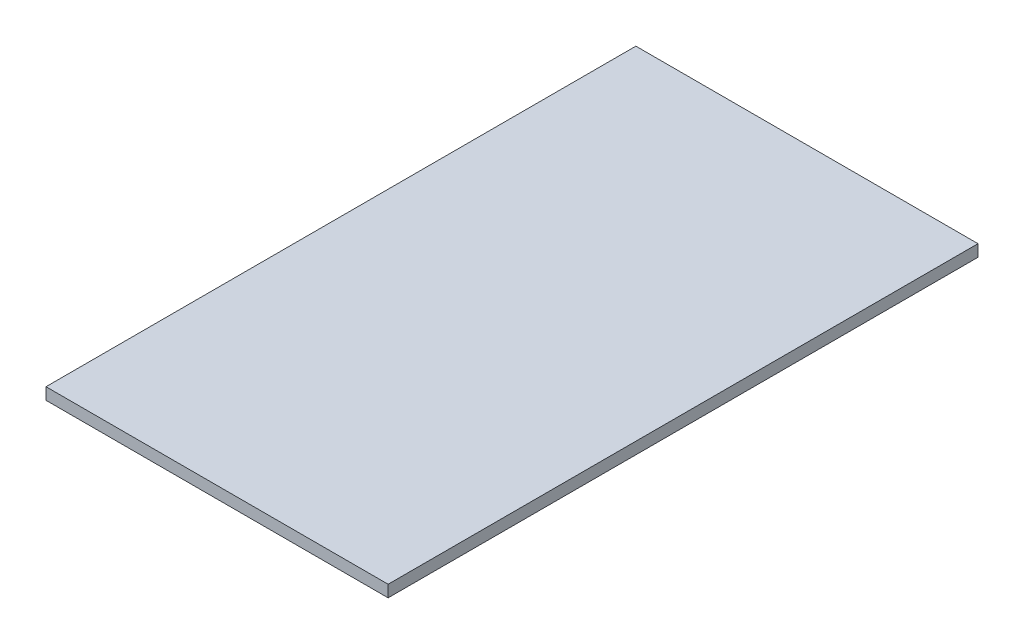
ISO-10303-21;
HEADER;
FILE_DESCRIPTION(('STEP AP214'),'2;1');
FILE_NAME('part.step','',(''),(''),'','','');
FILE_SCHEMA(('AUTOMOTIVE_DESIGN { 1 0 10303 214 1 1 1 1 }'));
ENDSEC;
DATA;
#1=APPLICATION_CONTEXT('core data for automotive mechanical design processes');
#2=APPLICATION_PROTOCOL_DEFINITION('international standard','automotive_design',2000,#1);
#3=PRODUCT_CONTEXT('',#1,'mechanical');
#4=PRODUCT('Part','Part','',(#3));
#5=PRODUCT_RELATED_PRODUCT_CATEGORY('part','',(#4));
#6=PRODUCT_DEFINITION_FORMATION('','',#4);
#7=PRODUCT_DEFINITION_CONTEXT('part definition',#1,'design');
#8=PRODUCT_DEFINITION('design','',#6,#7);
#9=PRODUCT_DEFINITION_SHAPE('','',#8);
#10=(LENGTH_UNIT() NAMED_UNIT(*) SI_UNIT(.MILLI.,.METRE.));
#11=(NAMED_UNIT(*) PLANE_ANGLE_UNIT() SI_UNIT($,.RADIAN.));
#12=(NAMED_UNIT(*) SI_UNIT($,.STERADIAN.) SOLID_ANGLE_UNIT());
#13=UNCERTAINTY_MEASURE_WITH_UNIT(LENGTH_MEASURE(1.E-05),#10,'distance_accuracy_value','');
#14=(GEOMETRIC_REPRESENTATION_CONTEXT(3) GLOBAL_UNCERTAINTY_ASSIGNED_CONTEXT((#13)) GLOBAL_UNIT_ASSIGNED_CONTEXT((#10,
#11,#12)) REPRESENTATION_CONTEXT('',''));
#15=CARTESIAN_POINT('',(0.,0.,0.));
#16=DIRECTION('',(0.,0.,1.));
#17=DIRECTION('',(1.,0.,0.));
#18=AXIS2_PLACEMENT_3D('',#15,#16,#17);
#19=CARTESIAN_POINT('',(0.,6.35,0.));
#20=DIRECTION('',(1.,0.,0.));
#21=DIRECTION('',(0.,0.,-1.));
#22=AXIS2_PLACEMENT_3D('',#19,#20,#21);
#23=PLANE('',#22);
#24=DIRECTION('',(0.,0.,1.));
#25=VECTOR('',#24,1.);
#26=CARTESIAN_POINT('',(0.,0.,0.));
#27=LINE('',#26,#25);
#28=CARTESIAN_POINT('',(0.,0.,-317.5));
#29=VERTEX_POINT('',#28);
#30=CARTESIAN_POINT('',(0.,0.,0.));
#31=VERTEX_POINT('',#30);
#32=EDGE_CURVE('E95',#29,#31,#27,.T.);
#33=ORIENTED_EDGE('',*,*,#32,.T.);
#34=DIRECTION('',(0.,-1.,0.));
#35=VECTOR('',#34,1.);
#36=CARTESIAN_POINT('',(0.,6.35,0.));
#37=LINE('',#36,#35);
#38=CARTESIAN_POINT('',(0.,6.35,0.));
#39=VERTEX_POINT('',#38);
#40=EDGE_CURVE('E11',#39,#31,#37,.T.);
#41=ORIENTED_EDGE('',*,*,#40,.F.);
#42=DIRECTION('',(0.,0.,1.));
#43=VECTOR('',#42,1.);
#44=CARTESIAN_POINT('',(0.,6.35,0.));
#45=LINE('',#44,#43);
#46=CARTESIAN_POINT('',(0.,6.35,-317.5));
#47=VERTEX_POINT('',#46);
#48=EDGE_CURVE('E83',#47,#39,#45,.T.);
#49=ORIENTED_EDGE('',*,*,#48,.F.);
#50=DIRECTION('',(0.,-1.,0.));
#51=VECTOR('',#50,1.);
#52=CARTESIAN_POINT('',(0.,6.35,-317.5));
#53=LINE('',#52,#51);
#54=EDGE_CURVE('E91',#47,#29,#53,.T.);
#55=ORIENTED_EDGE('',*,*,#54,.T.);
#56=EDGE_LOOP('',(#33,#41,#49,#55));
#57=FACE_BOUND('',#56,.T.);
#58=ADVANCED_FACE('F32',(#57),#23,.F.);
#59=CARTESIAN_POINT('',(0.,6.35,0.));
#60=DIRECTION('',(0.,0.,-1.));
#61=DIRECTION('',(-1.,0.,0.));
#62=AXIS2_PLACEMENT_3D('',#59,#60,#61);
#63=PLANE('',#62);
#64=DIRECTION('',(1.,0.,0.));
#65=VECTOR('',#64,1.);
#66=CARTESIAN_POINT('',(0.,0.,0.));
#67=LINE('',#66,#65);
#68=CARTESIAN_POINT('',(184.15,0.,0.));
#69=VERTEX_POINT('',#68);
#70=EDGE_CURVE('E87',#31,#69,#67,.T.);
#71=ORIENTED_EDGE('',*,*,#70,.T.);
#72=DIRECTION('',(0.,-1.,0.));
#73=VECTOR('',#72,1.);
#74=CARTESIAN_POINT('',(184.15,6.35,0.));
#75=LINE('',#74,#73);
#76=CARTESIAN_POINT('',(184.15,6.35,0.));
#77=VERTEX_POINT('',#76);
#78=EDGE_CURVE('E40',#77,#69,#75,.T.);
#79=ORIENTED_EDGE('',*,*,#78,.F.);
#80=DIRECTION('',(1.,0.,0.));
#81=VECTOR('',#80,1.);
#82=CARTESIAN_POINT('',(0.,6.35,0.));
#83=LINE('',#82,#81);
#84=EDGE_CURVE('E78',#39,#77,#83,.T.);
#85=ORIENTED_EDGE('',*,*,#84,.F.);
#86=ORIENTED_EDGE('',*,*,#40,.T.);
#87=EDGE_LOOP('',(#71,#79,#85,#86));
#88=FACE_BOUND('',#87,.T.);
#89=ADVANCED_FACE('F86',(#88),#63,.F.);
#90=CARTESIAN_POINT('',(184.15,6.35,0.));
#91=DIRECTION('',(-1.,0.,0.));
#92=DIRECTION('',(0.,0.,1.));
#93=AXIS2_PLACEMENT_3D('',#90,#91,#92);
#94=PLANE('',#93);
#95=DIRECTION('',(0.,0.,-1.));
#96=VECTOR('',#95,1.);
#97=CARTESIAN_POINT('',(184.15,0.,0.));
#98=LINE('',#97,#96);
#99=CARTESIAN_POINT('',(184.15,0.,-317.5));
#100=VERTEX_POINT('',#99);
#101=EDGE_CURVE('E65',#69,#100,#98,.T.);
#102=ORIENTED_EDGE('',*,*,#101,.T.);
#103=DIRECTION('',(0.,-1.,0.));
#104=VECTOR('',#103,1.);
#105=CARTESIAN_POINT('',(184.15,6.35,-317.5));
#106=LINE('',#105,#104);
#107=CARTESIAN_POINT('',(184.15,6.35,-317.5));
#108=VERTEX_POINT('',#107);
#109=EDGE_CURVE('E88',#108,#100,#106,.T.);
#110=ORIENTED_EDGE('',*,*,#109,.F.);
#111=DIRECTION('',(0.,0.,-1.));
#112=VECTOR('',#111,1.);
#113=CARTESIAN_POINT('',(184.15,6.35,0.));
#114=LINE('',#113,#112);
#115=EDGE_CURVE('E81',#77,#108,#114,.T.);
#116=ORIENTED_EDGE('',*,*,#115,.F.);
#117=ORIENTED_EDGE('',*,*,#78,.T.);
#118=EDGE_LOOP('',(#102,#110,#116,#117));
#119=FACE_BOUND('',#118,.T.);
#120=ADVANCED_FACE('F89',(#119),#94,.F.);
#121=CARTESIAN_POINT('',(0.,6.35,-317.5));
#122=DIRECTION('',(0.,0.,1.));
#123=DIRECTION('',(1.,0.,0.));
#124=AXIS2_PLACEMENT_3D('',#121,#122,#123);
#125=PLANE('',#124);
#126=DIRECTION('',(-1.,0.,0.));
#127=VECTOR('',#126,1.);
#128=CARTESIAN_POINT('',(0.,0.,-317.5));
#129=LINE('',#128,#127);
#130=EDGE_CURVE('E71',#100,#29,#129,.T.);
#131=ORIENTED_EDGE('',*,*,#130,.T.);
#132=ORIENTED_EDGE('',*,*,#54,.F.);
#133=DIRECTION('',(-1.,0.,0.));
#134=VECTOR('',#133,1.);
#135=CARTESIAN_POINT('',(0.,6.35,-317.5));
#136=LINE('',#135,#134);
#137=EDGE_CURVE('E48',#108,#47,#136,.T.);
#138=ORIENTED_EDGE('',*,*,#137,.F.);
#139=ORIENTED_EDGE('',*,*,#109,.T.);
#140=EDGE_LOOP('',(#131,#132,#138,#139));
#141=FACE_BOUND('',#140,.T.);
#142=ADVANCED_FACE('F102',(#141),#125,.F.);
#143=CARTESIAN_POINT('',(0.,6.35,0.));
#144=DIRECTION('',(0.,-1.,0.));
#145=DIRECTION('',(0.,0.,-1.));
#146=AXIS2_PLACEMENT_3D('',#143,#144,#145);
#147=PLANE('',#146);
#148=ORIENTED_EDGE('',*,*,#48,.T.);
#149=ORIENTED_EDGE('',*,*,#84,.T.);
#150=ORIENTED_EDGE('',*,*,#115,.T.);
#151=ORIENTED_EDGE('',*,*,#137,.T.);
#152=EDGE_LOOP('',(#148,#149,#150,#151));
#153=FACE_BOUND('',#152,.T.);
#154=ADVANCED_FACE('F79',(#153),#147,.F.);
#155=CARTESIAN_POINT('',(0.,0.,0.));
#156=DIRECTION('',(0.,-1.,0.));
#157=DIRECTION('',(0.,0.,-1.));
#158=AXIS2_PLACEMENT_3D('',#155,#156,#157);
#159=PLANE('',#158);
#160=ORIENTED_EDGE('',*,*,#32,.F.);
#161=ORIENTED_EDGE('',*,*,#130,.F.);
#162=ORIENTED_EDGE('',*,*,#101,.F.);
#163=ORIENTED_EDGE('',*,*,#70,.F.);
#164=EDGE_LOOP('',(#160,#161,#162,#163));
#165=FACE_BOUND('',#164,.T.);
#166=ADVANCED_FACE('F105',(#165),#159,.T.);
#167=CLOSED_SHELL('',(#58,#89,#120,#142,#154,#166));
#168=MANIFOLD_SOLID_BREP('B2',#167);
#169=ADVANCED_BREP_SHAPE_REPRESENTATION('',(#18,#168),#14);
#170=SHAPE_DEFINITION_REPRESENTATION(#9,#169);
ENDSEC;
END-ISO-10303-21;
